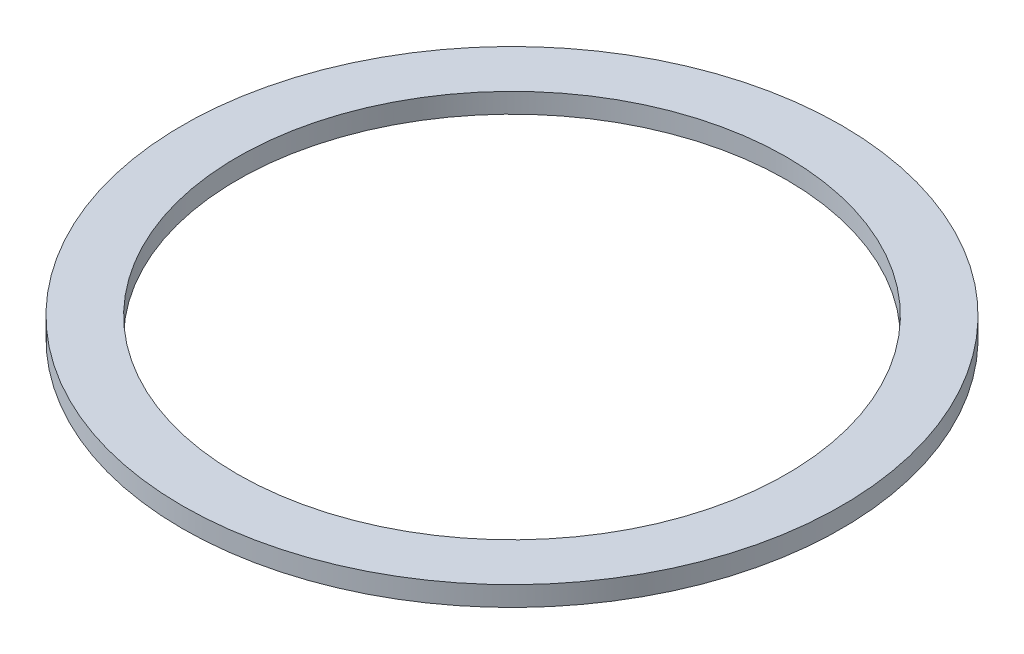
ISO-10303-21;
HEADER;
FILE_DESCRIPTION(('STEP AP214'),'2;1');
FILE_NAME('part.step','',(''),(''),'','','');
FILE_SCHEMA(('AUTOMOTIVE_DESIGN { 1 0 10303 214 1 1 1 1 }'));
ENDSEC;
DATA;
#1=APPLICATION_CONTEXT('core data for automotive mechanical design processes');
#2=APPLICATION_PROTOCOL_DEFINITION('international standard','automotive_design',2000,#1);
#3=PRODUCT_CONTEXT('',#1,'mechanical');
#4=PRODUCT('Part','Part','',(#3));
#5=PRODUCT_RELATED_PRODUCT_CATEGORY('part','',(#4));
#6=PRODUCT_DEFINITION_FORMATION('','',#4);
#7=PRODUCT_DEFINITION_CONTEXT('part definition',#1,'design');
#8=PRODUCT_DEFINITION('design','',#6,#7);
#9=PRODUCT_DEFINITION_SHAPE('','',#8);
#10=(LENGTH_UNIT() NAMED_UNIT(*) SI_UNIT(.MILLI.,.METRE.));
#11=(NAMED_UNIT(*) PLANE_ANGLE_UNIT() SI_UNIT($,.RADIAN.));
#12=(NAMED_UNIT(*) SI_UNIT($,.STERADIAN.) SOLID_ANGLE_UNIT());
#13=UNCERTAINTY_MEASURE_WITH_UNIT(LENGTH_MEASURE(1.E-05),#10,'distance_accuracy_value','');
#14=(GEOMETRIC_REPRESENTATION_CONTEXT(3) GLOBAL_UNCERTAINTY_ASSIGNED_CONTEXT((#13)) GLOBAL_UNIT_ASSIGNED_CONTEXT((#10,
#11,#12)) REPRESENTATION_CONTEXT('',''));
#15=CARTESIAN_POINT('',(0.,0.,0.));
#16=DIRECTION('',(0.,0.,1.));
#17=DIRECTION('',(1.,0.,0.));
#18=AXIS2_PLACEMENT_3D('',#15,#16,#17);
#19=CARTESIAN_POINT('',(0.,9.,0.));
#20=DIRECTION('',(0.,1.,0.));
#21=DIRECTION('',(0.,0.,1.));
#22=AXIS2_PLACEMENT_3D('',#19,#20,#21);
#23=PLANE('',#22);
#24=CARTESIAN_POINT('',(0.,9.,0.));
#25=DIRECTION('',(0.,1.,0.));
#26=DIRECTION('',(0.,0.,1.));
#27=AXIS2_PLACEMENT_3D('',#24,#25,#26);
#28=CIRCLE('',#27,150.);
#29=CARTESIAN_POINT('',(0.,9.,150.));
#30=VERTEX_POINT('',#29);
#31=EDGE_CURVE('E10',#30,#30,#28,.T.);
#32=ORIENTED_EDGE('',*,*,#31,.T.);
#33=EDGE_LOOP('',(#32));
#34=FACE_BOUND('',#33,.T.);
#35=CARTESIAN_POINT('',(0.,9.,0.));
#36=DIRECTION('',(0.,1.,0.));
#37=DIRECTION('',(0.,0.,1.));
#38=AXIS2_PLACEMENT_3D('',#35,#36,#37);
#39=CIRCLE('',#38,125.);
#40=CARTESIAN_POINT('',(0.,9.,125.));
#41=VERTEX_POINT('',#40);
#42=EDGE_CURVE('E45',#41,#41,#39,.T.);
#43=ORIENTED_EDGE('',*,*,#42,.F.);
#44=EDGE_LOOP('',(#43));
#45=FACE_BOUND('',#44,.T.);
#46=ADVANCED_FACE('F34',(#34,#45),#23,.T.);
#47=CARTESIAN_POINT('',(0.,0.,0.));
#48=DIRECTION('',(0.,1.,0.));
#49=DIRECTION('',(0.,0.,1.));
#50=AXIS2_PLACEMENT_3D('',#47,#48,#49);
#51=PLANE('',#50);
#52=CARTESIAN_POINT('',(0.,0.,0.));
#53=DIRECTION('',(0.,1.,0.));
#54=DIRECTION('',(0.,0.,1.));
#55=AXIS2_PLACEMENT_3D('',#52,#53,#54);
#56=CIRCLE('',#55,150.);
#57=CARTESIAN_POINT('',(0.,0.,150.));
#58=VERTEX_POINT('',#57);
#59=EDGE_CURVE('E38',#58,#58,#56,.T.);
#60=ORIENTED_EDGE('',*,*,#59,.F.);
#61=EDGE_LOOP('',(#60));
#62=FACE_BOUND('',#61,.T.);
#63=CARTESIAN_POINT('',(0.,0.,0.));
#64=DIRECTION('',(0.,1.,0.));
#65=DIRECTION('',(0.,0.,1.));
#66=AXIS2_PLACEMENT_3D('',#63,#64,#65);
#67=CIRCLE('',#66,125.);
#68=CARTESIAN_POINT('',(0.,0.,125.));
#69=VERTEX_POINT('',#68);
#70=EDGE_CURVE('E47',#69,#69,#67,.T.);
#71=ORIENTED_EDGE('',*,*,#70,.T.);
#72=EDGE_LOOP('',(#71));
#73=FACE_BOUND('',#72,.T.);
#74=ADVANCED_FACE('F57',(#62,#73),#51,.F.);
#75=CARTESIAN_POINT('',(0.,9.,0.));
#76=DIRECTION('',(0.,-1.,0.));
#77=DIRECTION('',(0.,0.,-1.));
#78=AXIS2_PLACEMENT_3D('',#75,#76,#77);
#79=CYLINDRICAL_SURFACE('',#78,150.);
#80=ORIENTED_EDGE('',*,*,#31,.F.);
#81=EDGE_LOOP('',(#80));
#82=FACE_BOUND('',#81,.T.);
#83=ORIENTED_EDGE('',*,*,#59,.T.);
#84=EDGE_LOOP('',(#83));
#85=FACE_BOUND('',#84,.T.);
#86=ADVANCED_FACE('F36',(#82,#85),#79,.T.);
#87=CARTESIAN_POINT('',(0.,9.,0.));
#88=DIRECTION('',(0.,-1.,0.));
#89=DIRECTION('',(0.,0.,-1.));
#90=AXIS2_PLACEMENT_3D('',#87,#88,#89);
#91=CYLINDRICAL_SURFACE('',#90,125.);
#92=ORIENTED_EDGE('',*,*,#42,.T.);
#93=EDGE_LOOP('',(#92));
#94=FACE_BOUND('',#93,.T.);
#95=ORIENTED_EDGE('',*,*,#70,.F.);
#96=EDGE_LOOP('',(#95));
#97=FACE_BOUND('',#96,.T.);
#98=ADVANCED_FACE('F53',(#94,#97),#91,.F.);
#99=CLOSED_SHELL('',(#46,#74,#86,#98));
#100=MANIFOLD_SOLID_BREP('B2',#99);
#101=ADVANCED_BREP_SHAPE_REPRESENTATION('',(#18,#100),#14);
#102=SHAPE_DEFINITION_REPRESENTATION(#9,#101);
ENDSEC;
END-ISO-10303-21;
